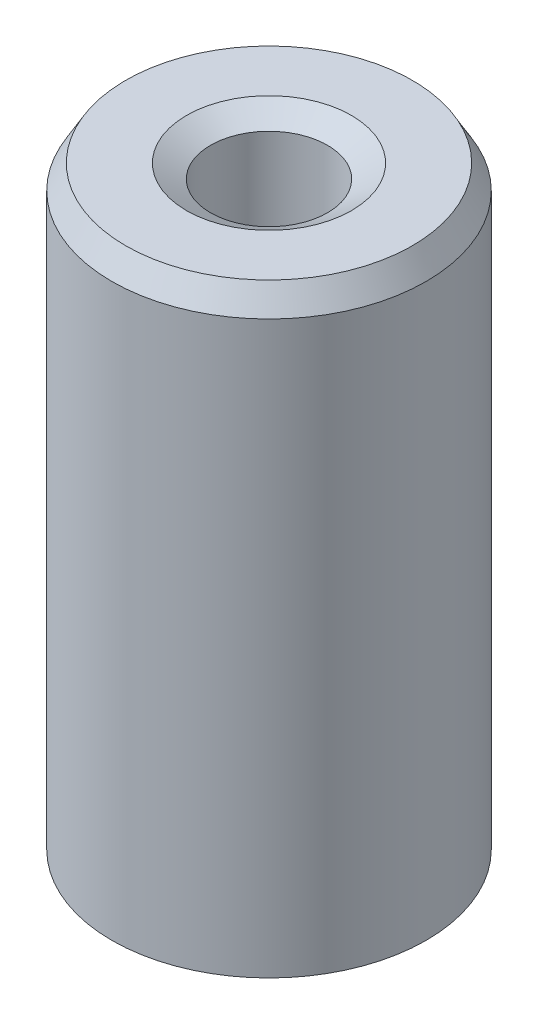
ISO-10303-21;
HEADER;
FILE_DESCRIPTION(('STEP AP214'),'2;1');
FILE_NAME('part.step','',(''),(''),'','','');
FILE_SCHEMA(('AUTOMOTIVE_DESIGN { 1 0 10303 214 1 1 1 1 }'));
ENDSEC;
DATA;
#1=APPLICATION_CONTEXT('core data for automotive mechanical design processes');
#2=APPLICATION_PROTOCOL_DEFINITION('international standard','automotive_design',2000,#1);
#3=PRODUCT_CONTEXT('',#1,'mechanical');
#4=PRODUCT('Part','Part','',(#3));
#5=PRODUCT_RELATED_PRODUCT_CATEGORY('part','',(#4));
#6=PRODUCT_DEFINITION_FORMATION('','',#4);
#7=PRODUCT_DEFINITION_CONTEXT('part definition',#1,'design');
#8=PRODUCT_DEFINITION('design','',#6,#7);
#9=PRODUCT_DEFINITION_SHAPE('','',#8);
#10=(LENGTH_UNIT() NAMED_UNIT(*) SI_UNIT(.MILLI.,.METRE.));
#11=(NAMED_UNIT(*) PLANE_ANGLE_UNIT() SI_UNIT($,.RADIAN.));
#12=(NAMED_UNIT(*) SI_UNIT($,.STERADIAN.) SOLID_ANGLE_UNIT());
#13=UNCERTAINTY_MEASURE_WITH_UNIT(LENGTH_MEASURE(1.E-05),#10,'distance_accuracy_value','');
#14=(GEOMETRIC_REPRESENTATION_CONTEXT(3) GLOBAL_UNCERTAINTY_ASSIGNED_CONTEXT((#13)) GLOBAL_UNIT_ASSIGNED_CONTEXT((#10,
#11,#12)) REPRESENTATION_CONTEXT('',''));
#15=CARTESIAN_POINT('',(0.,0.,0.));
#16=DIRECTION('',(0.,0.,1.));
#17=DIRECTION('',(1.,0.,0.));
#18=AXIS2_PLACEMENT_3D('',#15,#16,#17);
#19=CARTESIAN_POINT('',(0.,58.0728224030251,0.));
#20=DIRECTION('',(0.,-1.,0.));
#21=DIRECTION('',(0.,0.,-1.));
#22=AXIS2_PLACEMENT_3D('',#19,#20,#21);
#23=CYLINDRICAL_SURFACE('',#22,15.);
#24=CARTESIAN_POINT('',(0.,1.32147336492008,0.));
#25=DIRECTION('',(0.,1.,0.));
#26=DIRECTION('',(0.,0.,1.));
#27=AXIS2_PLACEMENT_3D('',#24,#25,#26);
#28=CIRCLE('',#27,15.);
#29=CARTESIAN_POINT('',(0.,1.32147336492008,15.));
#30=VERTEX_POINT('',#29);
#31=EDGE_CURVE('E10',#30,#30,#28,.T.);
#32=ORIENTED_EDGE('',*,*,#31,.T.);
#33=EDGE_LOOP('',(#32));
#34=FACE_BOUND('',#33,.T.);
#35=CARTESIAN_POINT('',(0.,55.7839633941345,0.));
#36=DIRECTION('',(0.,1.,0.));
#37=DIRECTION('',(0.,0.,1.));
#38=AXIS2_PLACEMENT_3D('',#35,#36,#37);
#39=CIRCLE('',#38,15.);
#40=CARTESIAN_POINT('',(0.,55.7839633941345,15.));
#41=VERTEX_POINT('',#40);
#42=EDGE_CURVE('E50',#41,#41,#39,.F.);
#43=ORIENTED_EDGE('',*,*,#42,.T.);
#44=EDGE_LOOP('',(#43));
#45=FACE_BOUND('',#44,.T.);
#46=ADVANCED_FACE('F39',(#34,#45),#23,.T.);
#47=CARTESIAN_POINT('',(0.,58.0728224030251,0.));
#48=DIRECTION('',(0.,1.,0.));
#49=DIRECTION('',(0.,0.,1.));
#50=AXIS2_PLACEMENT_3D('',#47,#48,#49);
#51=PLANE('',#50);
#52=CARTESIAN_POINT('',(0.,58.0728224030251,0.));
#53=DIRECTION('',(0.,1.,0.));
#54=DIRECTION('',(0.,0.,1.));
#55=AXIS2_PLACEMENT_3D('',#52,#53,#54);
#56=CIRCLE('',#55,7.87140876247783);
#57=CARTESIAN_POINT('',(0.,58.0728224030251,7.87140876247783));
#58=VERTEX_POINT('',#57);
#59=EDGE_CURVE('E58',#58,#58,#56,.F.);
#60=ORIENTED_EDGE('',*,*,#59,.T.);
#61=EDGE_LOOP('',(#60));
#62=FACE_BOUND('',#61,.T.);
#63=CARTESIAN_POINT('',(0.,58.0728224030251,0.));
#64=DIRECTION('',(0.,1.,0.));
#65=DIRECTION('',(0.,0.,1.));
#66=AXIS2_PLACEMENT_3D('',#63,#64,#65);
#67=CIRCLE('',#66,13.6785266350799);
#68=CARTESIAN_POINT('',(0.,58.0728224030251,13.6785266350799));
#69=VERTEX_POINT('',#68);
#70=EDGE_CURVE('E61',#69,#69,#67,.T.);
#71=ORIENTED_EDGE('',*,*,#70,.T.);
#72=EDGE_LOOP('',(#71));
#73=FACE_BOUND('',#72,.T.);
#74=ADVANCED_FACE('F88',(#62,#73),#51,.T.);
#75=CARTESIAN_POINT('',(0.,0.,0.));
#76=DIRECTION('',(0.,1.,0.));
#77=DIRECTION('',(0.,0.,1.));
#78=AXIS2_PLACEMENT_3D('',#75,#76,#77);
#79=PLANE('',#78);
#80=CARTESIAN_POINT('',(0.,0.,0.));
#81=DIRECTION('',(0.,1.,0.));
#82=DIRECTION('',(0.,0.,1.));
#83=AXIS2_PLACEMENT_3D('',#80,#81,#82);
#84=CIRCLE('',#83,6.90402311850729);
#85=CARTESIAN_POINT('',(0.,0.,6.90402311850729));
#86=VERTEX_POINT('',#85);
#87=EDGE_CURVE('E51',#86,#86,#84,.T.);
#88=ORIENTED_EDGE('',*,*,#87,.T.);
#89=EDGE_LOOP('',(#88));
#90=FACE_BOUND('',#89,.T.);
#91=CARTESIAN_POINT('',(0.,0.,0.));
#92=DIRECTION('',(0.,1.,0.));
#93=DIRECTION('',(0.,0.,1.));
#94=AXIS2_PLACEMENT_3D('',#91,#92,#93);
#95=CIRCLE('',#94,12.7111409911094);
#96=CARTESIAN_POINT('',(0.,0.,12.7111409911094));
#97=VERTEX_POINT('',#96);
#98=EDGE_CURVE('E54',#97,#97,#95,.F.);
#99=ORIENTED_EDGE('',*,*,#98,.T.);
#100=EDGE_LOOP('',(#99));
#101=FACE_BOUND('',#100,.T.);
#102=ADVANCED_FACE('F83',(#90,#101),#79,.F.);
#103=CARTESIAN_POINT('',(0.,58.0728224030251,0.));
#104=DIRECTION('',(0.,-1.,0.));
#105=DIRECTION('',(0.,0.,-1.));
#106=AXIS2_PLACEMENT_3D('',#103,#104,#105);
#107=CYLINDRICAL_SURFACE('',#106,5.58254975358722);
#108=CARTESIAN_POINT('',(0.,56.751349038105,0.));
#109=DIRECTION('',(0.,1.,0.));
#110=DIRECTION('',(0.,0.,1.));
#111=AXIS2_PLACEMENT_3D('',#108,#109,#110);
#112=CIRCLE('',#111,5.58254975358722);
#113=CARTESIAN_POINT('',(0.,56.751349038105,5.58254975358722));
#114=VERTEX_POINT('',#113);
#115=EDGE_CURVE('E67',#114,#114,#112,.T.);
#116=ORIENTED_EDGE('',*,*,#115,.T.);
#117=EDGE_LOOP('',(#116));
#118=FACE_BOUND('',#117,.T.);
#119=CARTESIAN_POINT('',(0.,2.28885900889059,0.));
#120=DIRECTION('',(0.,1.,0.));
#121=DIRECTION('',(0.,0.,1.));
#122=AXIS2_PLACEMENT_3D('',#119,#120,#121);
#123=CIRCLE('',#122,5.58254975358722);
#124=CARTESIAN_POINT('',(0.,2.28885900889059,5.58254975358722));
#125=VERTEX_POINT('',#124);
#126=EDGE_CURVE('E69',#125,#125,#123,.F.);
#127=ORIENTED_EDGE('',*,*,#126,.T.);
#128=EDGE_LOOP('',(#127));
#129=FACE_BOUND('',#128,.T.);
#130=ADVANCED_FACE('F71',(#118,#129),#107,.F.);
#131=CARTESIAN_POINT('',(0.,56.751349038105,0.));
#132=DIRECTION('',(0.,1.,0.));
#133=DIRECTION('',(0.,0.,1.));
#134=AXIS2_PLACEMENT_3D('',#131,#132,#133);
#135=CONICAL_SURFACE('',#134,5.58254975358722,1.0471975511966);
#136=ORIENTED_EDGE('',*,*,#59,.F.);
#137=EDGE_LOOP('',(#136));
#138=FACE_BOUND('',#137,.T.);
#139=ORIENTED_EDGE('',*,*,#115,.F.);
#140=EDGE_LOOP('',(#139));
#141=FACE_BOUND('',#140,.T.);
#142=ADVANCED_FACE('F77',(#138,#141),#135,.F.);
#143=CARTESIAN_POINT('',(0.,0.,0.));
#144=DIRECTION('',(0.,-1.,0.));
#145=DIRECTION('',(0.,0.,-1.));
#146=AXIS2_PLACEMENT_3D('',#143,#144,#145);
#147=CONICAL_SURFACE('',#146,6.90402311850729,0.523598775598296);
#148=ORIENTED_EDGE('',*,*,#126,.F.);
#149=EDGE_LOOP('',(#148));
#150=FACE_BOUND('',#149,.T.);
#151=ORIENTED_EDGE('',*,*,#87,.F.);
#152=EDGE_LOOP('',(#151));
#153=FACE_BOUND('',#152,.T.);
#154=ADVANCED_FACE('F73',(#150,#153),#147,.F.);
#155=CARTESIAN_POINT('',(0.,1.32147336492008,0.));
#156=DIRECTION('',(0.,1.,0.));
#157=DIRECTION('',(0.,0.,1.));
#158=AXIS2_PLACEMENT_3D('',#155,#156,#157);
#159=CONICAL_SURFACE('',#158,15.,1.0471975511966);
#160=CARTESIAN_POINT('',(0.,0.,12.7111409911094));
#161=CARTESIAN_POINT('',(0.,0.0137653475512506,12.734983272452));
#162=CARTESIAN_POINT('',(0.,0.0275306951025014,12.7588255537946));
#163=CARTESIAN_POINT('',(0.,0.055061390205003,12.8065101164798));
#164=CARTESIAN_POINT('',(0.,0.0688267377562538,12.8303523978225));
#165=CARTESIAN_POINT('',(0.,0.0963574328587554,12.8780369605077));
#166=CARTESIAN_POINT('',(0.,0.110122780410006,12.9018792418503));
#167=CARTESIAN_POINT('',(0.,0.137653475512508,12.9495638045355));
#168=CARTESIAN_POINT('',(0.,0.151418823063759,12.9734060858781));
#169=CARTESIAN_POINT('',(0.,0.17894951816626,13.0210906485633));
#170=CARTESIAN_POINT('',(0.,0.192714865717511,13.0449329299059));
#171=CARTESIAN_POINT('',(0.,0.220245560820013,13.0926174925912));
#172=CARTESIAN_POINT('',(0.,0.234010908371264,13.1164597739338));
#173=CARTESIAN_POINT('',(0.,0.261541603473765,13.164144336619));
#174=CARTESIAN_POINT('',(0.,0.275306951025016,13.1879866179616));
#175=CARTESIAN_POINT('',(0.,0.302837646127517,13.2356711806468));
#176=CARTESIAN_POINT('',(0.,0.316602993678768,13.2595134619894));
#177=CARTESIAN_POINT('',(0.,0.34413368878127,13.3071980246747));
#178=CARTESIAN_POINT('',(0.,0.357899036332521,13.3310403060173));
#179=CARTESIAN_POINT('',(0.,0.385429731435022,13.3787248687025));
#180=CARTESIAN_POINT('',(0.,0.399195078986273,13.4025671500451));
#181=CARTESIAN_POINT('',(0.,0.426725774088775,13.4502517127303));
#182=CARTESIAN_POINT('',(0.,0.440491121640026,13.4740939940729));
#183=CARTESIAN_POINT('',(0.,0.468021816742527,13.5217785567582));
#184=CARTESIAN_POINT('',(0.,0.481787164293778,13.5456208381008));
#185=CARTESIAN_POINT('',(0.,0.509317859396279,13.593305400786));
#186=CARTESIAN_POINT('',(0.,0.52308320694753,13.6171476821286));
#187=CARTESIAN_POINT('',(0.,0.550613902050032,13.6648322448138));
#188=CARTESIAN_POINT('',(0.,0.564379249601283,13.6886745261564));
#189=CARTESIAN_POINT('',(0.,0.591909944703784,13.7363590888417));
#190=CARTESIAN_POINT('',(0.,0.605675292255035,13.7602013701843));
#191=CARTESIAN_POINT('',(0.,0.633205987357537,13.8078859328695));
#192=CARTESIAN_POINT('',(0.,0.646971334908788,13.8317282142121));
#193=CARTESIAN_POINT('',(0.,0.674502030011289,13.8794127768973));
#194=CARTESIAN_POINT('',(0.,0.68826737756254,13.9032550582399));
#195=CARTESIAN_POINT('',(0.,0.715798072665042,13.9509396209251));
#196=CARTESIAN_POINT('',(0.,0.729563420216292,13.9747819022678));
#197=CARTESIAN_POINT('',(0.,0.757094115318794,14.022466464953));
#198=CARTESIAN_POINT('',(0.,0.770859462870045,14.0463087462956));
#199=CARTESIAN_POINT('',(0.,0.798390157972546,14.0939933089808));
#200=CARTESIAN_POINT('',(0.,0.812155505523797,14.1178355903234));
#201=CARTESIAN_POINT('',(0.,0.839686200626299,14.1655201530086));
#202=CARTESIAN_POINT('',(0.,0.85345154817755,14.1893624343512));
#203=CARTESIAN_POINT('',(0.,0.880982243280051,14.2370469970365));
#204=CARTESIAN_POINT('',(0.,0.894747590831302,14.2608892783791));
#205=CARTESIAN_POINT('',(0.,0.922278285933804,14.3085738410643));
#206=CARTESIAN_POINT('',(0.,0.936043633485054,14.3324161224069));
#207=CARTESIAN_POINT('',(0.,0.963574328587556,14.3801006850921));
#208=CARTESIAN_POINT('',(0.,0.977339676138807,14.4039429664347));
#209=CARTESIAN_POINT('',(0.,1.00487037124131,14.45162752912));
#210=CARTESIAN_POINT('',(0.,1.01863571879256,14.4754698104626));
#211=CARTESIAN_POINT('',(0.,1.04616641389506,14.5231543731478));
#212=CARTESIAN_POINT('',(0.,1.05993176144631,14.5469966544904));
#213=CARTESIAN_POINT('',(0.,1.08746245654881,14.5946812171756));
#214=CARTESIAN_POINT('',(0.,1.10122780410006,14.6185234985182));
#215=CARTESIAN_POINT('',(0.,1.12875849920257,14.6662080612035));
#216=CARTESIAN_POINT('',(0.,1.14252384675382,14.6900503425461));
#217=CARTESIAN_POINT('',(0.,1.17005454185632,14.7377349052313));
#218=CARTESIAN_POINT('',(0.,1.18381988940757,14.7615771865739));
#219=CARTESIAN_POINT('',(0.,1.21135058451007,14.8092617492591));
#220=CARTESIAN_POINT('',(0.,1.22511593206132,14.8331040306017));
#221=CARTESIAN_POINT('',(0.,1.25264662716382,14.8807885932869));
#222=CARTESIAN_POINT('',(0.,1.26641197471507,14.9046308746296));
#223=CARTESIAN_POINT('',(0.,1.29394266981758,14.9523154373148));
#224=CARTESIAN_POINT('',(0.,1.30770801736883,14.9761577186574));
#225=CARTESIAN_POINT('',(0.,1.32147336492008,15.));
#226=B_SPLINE_CURVE_WITH_KNOTS('',3,(#160,#161,#162,#163,#164,#165,#166,#167,#168,#169,#170,
#171,#172,#173,#174,#175,#176,#177,#178,#179,#180,#181,#182,#183,#184,#185,#186,#187,#188,#189,
#190,#191,#192,#193,#194,#195,#196,#197,#198,#199,#200,#201,#202,#203,#204,#205,#206,#207,#208,
#209,#210,#211,#212,#213,#214,#215,#216,#217,#218,#219,#220,#221,#222,#223,#224,#225),
.UNSPECIFIED.,.F.,.F.,(4,2,2,2,2,2,2,2,2,2,2,2,2,2,2,2,2,2,2,2,2,2,2,2,2,2,2,2,2,2,2,2,4),(0.,
0.082592085307505,0.16518417061501,0.247776255922515,0.33036834123002,0.412960426537525,
0.49555251184503,0.578144597152536,0.660736682460041,0.743328767767546,0.825920853075051,
0.908512938382556,0.991105023690061,1.07369710899757,1.15628919430507,1.23888127961258,
1.32147336492008,1.40406545022759,1.48665753553509,1.5692496208426,1.6518417061501,
1.73443379145761,1.81702587676511,1.89961796207262,1.98221004738012,2.06480213268763,
2.14739421799513,2.22998630330264,2.31257838861015,2.39517047391765,2.47776255922515,
2.56035464453266,2.64294672984016),.UNSPECIFIED.);
#227=EDGE_CURVE('BSEAM76',#97,#30,#226,.T.);
#228=ORIENTED_EDGE('',*,*,#98,.F.);
#229=ORIENTED_EDGE('',*,*,#31,.F.);
#230=ORIENTED_EDGE('',*,*,#227,.T.);
#231=ORIENTED_EDGE('',*,*,#227,.F.);
#232=EDGE_LOOP('',(#228,#230,#229,#231));
#233=FACE_BOUND('',#232,.T.);
#234=ADVANCED_FACE('F76',(#233),#159,.T.);
#235=CARTESIAN_POINT('',(0.,58.0728224030251,0.));
#236=DIRECTION('',(0.,-1.,0.));
#237=DIRECTION('',(0.,0.,-1.));
#238=AXIS2_PLACEMENT_3D('',#235,#236,#237);
#239=CONICAL_SURFACE('',#238,13.6785266350799,0.523598775598292);
#240=ORIENTED_EDGE('',*,*,#42,.F.);
#241=EDGE_LOOP('',(#240));
#242=FACE_BOUND('',#241,.T.);
#243=ORIENTED_EDGE('',*,*,#70,.F.);
#244=EDGE_LOOP('',(#243));
#245=FACE_BOUND('',#244,.T.);
#246=ADVANCED_FACE('F45',(#242,#245),#239,.T.);
#247=CLOSED_SHELL('',(#46,#74,#102,#130,#142,#154,#234,#246));
#248=MANIFOLD_SOLID_BREP('B2',#247);
#249=ADVANCED_BREP_SHAPE_REPRESENTATION('',(#18,#248),#14);
#250=SHAPE_DEFINITION_REPRESENTATION(#9,#249);
ENDSEC;
END-ISO-10303-21;
